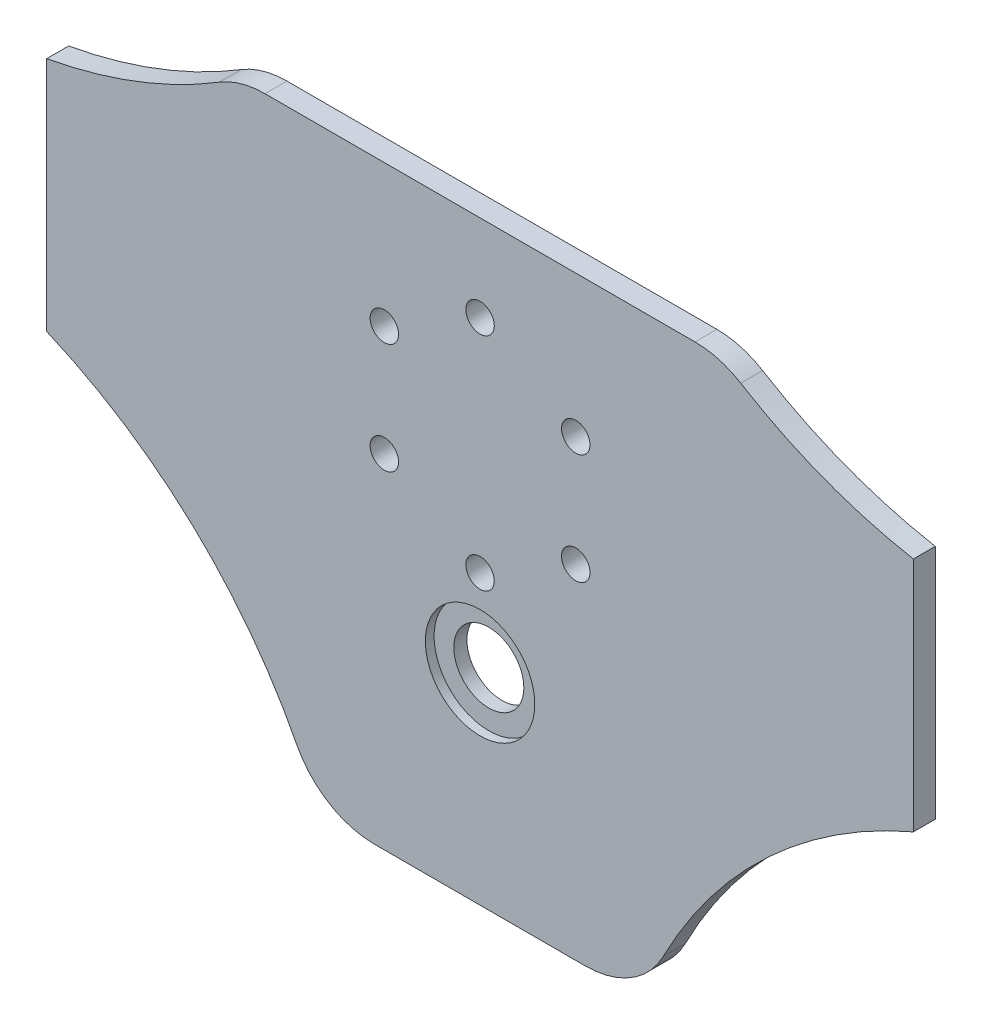
ISO-10303-21;
HEADER;
FILE_DESCRIPTION(('STEP AP214'),'2;1');
FILE_NAME('part.step','',(''),(''),'','','');
FILE_SCHEMA(('AUTOMOTIVE_DESIGN { 1 0 10303 214 1 1 1 1 }'));
ENDSEC;
DATA;
#1=APPLICATION_CONTEXT('core data for automotive mechanical design processes');
#2=APPLICATION_PROTOCOL_DEFINITION('international standard','automotive_design',2000,#1);
#3=PRODUCT_CONTEXT('',#1,'mechanical');
#4=PRODUCT('Part','Part','',(#3));
#5=PRODUCT_RELATED_PRODUCT_CATEGORY('part','',(#4));
#6=PRODUCT_DEFINITION_FORMATION('','',#4);
#7=PRODUCT_DEFINITION_CONTEXT('part definition',#1,'design');
#8=PRODUCT_DEFINITION('design','',#6,#7);
#9=PRODUCT_DEFINITION_SHAPE('','',#8);
#10=(LENGTH_UNIT() NAMED_UNIT(*) SI_UNIT(.MILLI.,.METRE.));
#11=(NAMED_UNIT(*) PLANE_ANGLE_UNIT() SI_UNIT($,.RADIAN.));
#12=(NAMED_UNIT(*) SI_UNIT($,.STERADIAN.) SOLID_ANGLE_UNIT());
#13=UNCERTAINTY_MEASURE_WITH_UNIT(LENGTH_MEASURE(1.E-05),#10,'distance_accuracy_value','');
#14=(GEOMETRIC_REPRESENTATION_CONTEXT(3) GLOBAL_UNCERTAINTY_ASSIGNED_CONTEXT((#13)) GLOBAL_UNIT_ASSIGNED_CONTEXT((#10,
#11,#12)) REPRESENTATION_CONTEXT('',''));
#15=CARTESIAN_POINT('',(0.,0.,0.));
#16=DIRECTION('',(0.,0.,1.));
#17=DIRECTION('',(1.,0.,0.));
#18=AXIS2_PLACEMENT_3D('',#15,#16,#17);
#19=CARTESIAN_POINT('',(0.,-22.,5.));
#20=DIRECTION('',(0.,0.,-1.));
#21=DIRECTION('',(-1.,0.,0.));
#22=AXIS2_PLACEMENT_3D('',#19,#20,#21);
#23=CYLINDRICAL_SURFACE('',#22,8.);
#24=CARTESIAN_POINT('',(0.,-22.,0.));
#25=DIRECTION('',(0.,0.,1.));
#26=DIRECTION('',(1.,0.,0.));
#27=AXIS2_PLACEMENT_3D('',#24,#25,#26);
#28=CIRCLE('',#27,8.);
#29=CARTESIAN_POINT('',(8.00000000000001,-22.,0.));
#30=VERTEX_POINT('',#29);
#31=EDGE_CURVE('E338',#30,#30,#28,.T.);
#32=ORIENTED_EDGE('',*,*,#31,.F.);
#33=EDGE_LOOP('',(#32));
#34=FACE_BOUND('',#33,.T.);
#35=CARTESIAN_POINT('',(0.,-22.,3.));
#36=DIRECTION('',(0.,0.,1.));
#37=DIRECTION('',(1.,0.,0.));
#38=AXIS2_PLACEMENT_3D('',#35,#36,#37);
#39=CIRCLE('',#38,8.);
#40=CARTESIAN_POINT('',(8.00000000000001,-22.,3.));
#41=VERTEX_POINT('',#40);
#42=EDGE_CURVE('E367',#41,#41,#39,.T.);
#43=ORIENTED_EDGE('',*,*,#42,.T.);
#44=EDGE_LOOP('',(#43));
#45=FACE_BOUND('',#44,.T.);
#46=ADVANCED_FACE('F35',(#34,#45),#23,.F.);
#47=CARTESIAN_POINT('',(119.602505223607,163.139457213261,5.));
#48=DIRECTION('',(0.,0.,-1.));
#49=DIRECTION('',(-1.,0.,0.));
#50=AXIS2_PLACEMENT_3D('',#47,#48,#49);
#51=PLANE('',#50);
#52=CARTESIAN_POINT('',(0.,-22.,5.));
#53=DIRECTION('',(0.,0.,1.));
#54=DIRECTION('',(1.,0.,0.));
#55=AXIS2_PLACEMENT_3D('',#52,#53,#54);
#56=CIRCLE('',#55,12.5);
#57=CARTESIAN_POINT('',(12.5,-22.,5.));
#58=VERTEX_POINT('',#57);
#59=EDGE_CURVE('E344',#58,#58,#56,.T.);
#60=ORIENTED_EDGE('',*,*,#59,.F.);
#61=EDGE_LOOP('',(#60));
#62=FACE_BOUND('',#61,.T.);
#63=CARTESIAN_POINT('',(119.602505223607,163.139457213261,5.));
#64=DIRECTION('',(0.,0.,-1.));
#65=DIRECTION('',(-1.,0.,0.));
#66=AXIS2_PLACEMENT_3D('',#63,#64,#65);
#67=CIRCLE('',#66,115.);
#68=CARTESIAN_POINT('',(99.,50.,5.));
#69=VERTEX_POINT('',#68);
#70=CARTESIAN_POINT('',(59.5611162901894,65.0576973649275,5.));
#71=VERTEX_POINT('',#70);
#72=EDGE_CURVE('E180',#69,#71,#67,.T.);
#73=ORIENTED_EDGE('',*,*,#72,.T.);
#74=CARTESIAN_POINT('',(49.1191356061168,48.,5.));
#75=DIRECTION('',(0.,0.,1.));
#76=DIRECTION('',(1.,0.,0.));
#77=AXIS2_PLACEMENT_3D('',#74,#75,#76);
#78=CIRCLE('',#77,20.);
#79=CARTESIAN_POINT('',(49.1191356061168,68.,5.));
#80=VERTEX_POINT('',#79);
#81=EDGE_CURVE('E107',#71,#80,#78,.T.);
#82=ORIENTED_EDGE('',*,*,#81,.T.);
#83=DIRECTION('',(-1.,0.,0.));
#84=VECTOR('',#83,1.);
#85=CARTESIAN_POINT('',(-49.1191356061168,68.,5.));
#86=LINE('',#85,#84);
#87=CARTESIAN_POINT('',(-49.1191356061168,68.,5.));
#88=VERTEX_POINT('',#87);
#89=EDGE_CURVE('E207',#80,#88,#86,.T.);
#90=ORIENTED_EDGE('',*,*,#89,.T.);
#91=CARTESIAN_POINT('',(-49.1191356061168,48.,5.));
#92=DIRECTION('',(0.,0.,1.));
#93=DIRECTION('',(-1.,0.,0.));
#94=AXIS2_PLACEMENT_3D('',#91,#92,#93);
#95=CIRCLE('',#94,20.);
#96=CARTESIAN_POINT('',(-59.5611162901894,65.0576973649275,5.));
#97=VERTEX_POINT('',#96);
#98=EDGE_CURVE('E226',#88,#97,#95,.T.);
#99=ORIENTED_EDGE('',*,*,#98,.T.);
#100=CARTESIAN_POINT('',(-119.602505223607,163.139457213261,5.));
#101=DIRECTION('',(0.,0.,-1.));
#102=DIRECTION('',(1.,0.,0.));
#103=AXIS2_PLACEMENT_3D('',#100,#101,#102);
#104=CIRCLE('',#103,115.);
#105=CARTESIAN_POINT('',(-99.,50.,5.));
#106=VERTEX_POINT('',#105);
#107=EDGE_CURVE('E223',#97,#106,#104,.T.);
#108=ORIENTED_EDGE('',*,*,#107,.T.);
#109=DIRECTION('',(0.,-1.,0.));
#110=VECTOR('',#109,1.);
#111=CARTESIAN_POINT('',(-99.,-3.99999999999998,5.));
#112=LINE('',#111,#110);
#113=CARTESIAN_POINT('',(-99.0000000000001,-4.,5.));
#114=VERTEX_POINT('',#113);
#115=EDGE_CURVE('E225',#106,#114,#112,.T.);
#116=ORIENTED_EDGE('',*,*,#115,.T.);
#117=CARTESIAN_POINT('',(-144.147014112087,-109.767419921084,5.));
#118=DIRECTION('',(0.,0.,-1.));
#119=DIRECTION('',(1.,0.,0.));
#120=AXIS2_PLACEMENT_3D('',#117,#118,#119);
#121=CIRCLE('',#120,115.);
#122=CARTESIAN_POINT('',(-41.8900641106708,-57.1507288771977,5.));
#123=VERTEX_POINT('',#122);
#124=EDGE_CURVE('E228',#114,#123,#121,.T.);
#125=ORIENTED_EDGE('',*,*,#124,.T.);
#126=CARTESIAN_POINT('',(-24.1062467191201,-48.,5.));
#127=DIRECTION('',(0.,0.,1.));
#128=DIRECTION('',(-1.,0.,0.));
#129=AXIS2_PLACEMENT_3D('',#126,#127,#128);
#130=CIRCLE('',#129,20.);
#131=CARTESIAN_POINT('',(-24.1062467191201,-68.,5.));
#132=VERTEX_POINT('',#131);
#133=EDGE_CURVE('E234',#123,#132,#130,.T.);
#134=ORIENTED_EDGE('',*,*,#133,.T.);
#135=DIRECTION('',(1.,0.,0.));
#136=VECTOR('',#135,1.);
#137=CARTESIAN_POINT('',(-24.1062467191201,-68.,5.));
#138=LINE('',#137,#136);
#139=CARTESIAN_POINT('',(24.1062467191201,-68.,5.));
#140=VERTEX_POINT('',#139);
#141=EDGE_CURVE('E139',#132,#140,#138,.T.);
#142=ORIENTED_EDGE('',*,*,#141,.T.);
#143=CARTESIAN_POINT('',(24.1062467191201,-48.,5.));
#144=DIRECTION('',(0.,0.,1.));
#145=DIRECTION('',(1.,0.,0.));
#146=AXIS2_PLACEMENT_3D('',#143,#144,#145);
#147=CIRCLE('',#146,20.);
#148=CARTESIAN_POINT('',(41.8900641106707,-57.1507288771977,5.));
#149=VERTEX_POINT('',#148);
#150=EDGE_CURVE('E132',#140,#149,#147,.T.);
#151=ORIENTED_EDGE('',*,*,#150,.T.);
#152=CARTESIAN_POINT('',(144.147014112087,-109.767419921084,5.));
#153=DIRECTION('',(0.,0.,-1.));
#154=DIRECTION('',(-1.,0.,0.));
#155=AXIS2_PLACEMENT_3D('',#152,#153,#154);
#156=CIRCLE('',#155,115.);
#157=CARTESIAN_POINT('',(99.,-3.99999999999998,5.));
#158=VERTEX_POINT('',#157);
#159=EDGE_CURVE('E137',#149,#158,#156,.T.);
#160=ORIENTED_EDGE('',*,*,#159,.T.);
#161=DIRECTION('',(0.,1.,0.));
#162=VECTOR('',#161,1.);
#163=CARTESIAN_POINT('',(99.,-3.99999999999998,5.));
#164=LINE('',#163,#162);
#165=EDGE_CURVE('E52',#158,#69,#164,.T.);
#166=ORIENTED_EDGE('',*,*,#165,.T.);
#167=EDGE_LOOP('',(#73,#82,#90,#99,#108,#116,#125,#134,#142,#151,#160,#166));
#168=FACE_BOUND('',#167,.T.);
#169=CARTESIAN_POINT('',(21.867141445558,35.6250000000015,5.));
#170=DIRECTION('',(0.,0.,1.));
#171=DIRECTION('',(1.,0.,0.));
#172=AXIS2_PLACEMENT_3D('',#169,#170,#171);
#173=CIRCLE('',#172,3.25);
#174=CARTESIAN_POINT('',(25.117141445558,35.6250000000015,5.));
#175=VERTEX_POINT('',#174);
#176=EDGE_CURVE('E161',#175,#175,#173,.T.);
#177=ORIENTED_EDGE('',*,*,#176,.F.);
#178=EDGE_LOOP('',(#177));
#179=FACE_BOUND('',#178,.T.);
#180=CARTESIAN_POINT('',(21.8671414455597,10.3750000000015,5.));
#181=DIRECTION('',(0.,0.,1.));
#182=DIRECTION('',(1.,0.,0.));
#183=AXIS2_PLACEMENT_3D('',#180,#181,#182);
#184=CIRCLE('',#183,3.25);
#185=CARTESIAN_POINT('',(25.1171414455597,10.3750000000015,5.));
#186=VERTEX_POINT('',#185);
#187=EDGE_CURVE('E311',#186,#186,#184,.T.);
#188=ORIENTED_EDGE('',*,*,#187,.F.);
#189=EDGE_LOOP('',(#188));
#190=FACE_BOUND('',#189,.T.);
#191=CARTESIAN_POINT('',(3.4050629859017E-12,-2.24999999999997,5.));
#192=DIRECTION('',(0.,0.,1.));
#193=DIRECTION('',(1.,0.,0.));
#194=AXIS2_PLACEMENT_3D('',#191,#192,#193);
#195=CIRCLE('',#194,3.25);
#196=CARTESIAN_POINT('',(3.25000000000341,-2.24999999999997,5.));
#197=VERTEX_POINT('',#196);
#198=EDGE_CURVE('E312',#197,#197,#195,.T.);
#199=ORIENTED_EDGE('',*,*,#198,.F.);
#200=EDGE_LOOP('',(#199));
#201=FACE_BOUND('',#200,.T.);
#202=CARTESIAN_POINT('',(-21.8671414455545,10.3749999999987,5.));
#203=DIRECTION('',(0.,0.,1.));
#204=DIRECTION('',(1.,0.,0.));
#205=AXIS2_PLACEMENT_3D('',#202,#203,#204);
#206=CIRCLE('',#205,3.25);
#207=CARTESIAN_POINT('',(-18.6171414455545,10.3749999999987,5.));
#208=VERTEX_POINT('',#207);
#209=EDGE_CURVE('E354',#208,#208,#206,.T.);
#210=ORIENTED_EDGE('',*,*,#209,.F.);
#211=EDGE_LOOP('',(#210));
#212=FACE_BOUND('',#211,.T.);
#213=CARTESIAN_POINT('',(0.,48.25,5.));
#214=DIRECTION('',(0.,0.,1.));
#215=DIRECTION('',(1.,0.,0.));
#216=AXIS2_PLACEMENT_3D('',#213,#214,#215);
#217=CIRCLE('',#216,3.25);
#218=CARTESIAN_POINT('',(3.25,48.25,5.));
#219=VERTEX_POINT('',#218);
#220=EDGE_CURVE('E350',#219,#219,#217,.T.);
#221=ORIENTED_EDGE('',*,*,#220,.F.);
#222=EDGE_LOOP('',(#221));
#223=FACE_BOUND('',#222,.T.);
#224=CARTESIAN_POINT('',(-21.867141445556,35.6249999999987,5.));
#225=DIRECTION('',(0.,0.,1.));
#226=DIRECTION('',(1.,0.,0.));
#227=AXIS2_PLACEMENT_3D('',#224,#225,#226);
#228=CIRCLE('',#227,3.24999999999999);
#229=CARTESIAN_POINT('',(-18.617141445556,35.6249999999987,5.));
#230=VERTEX_POINT('',#229);
#231=EDGE_CURVE('E341',#230,#230,#228,.T.);
#232=ORIENTED_EDGE('',*,*,#231,.F.);
#233=EDGE_LOOP('',(#232));
#234=FACE_BOUND('',#233,.T.);
#235=ADVANCED_FACE('F134',(#62,#168,#179,#190,#201,#212,#223,#234),#51,.F.);
#236=CARTESIAN_POINT('',(119.602505223607,163.139457213261,0.));
#237=DIRECTION('',(0.,0.,-1.));
#238=DIRECTION('',(-1.,0.,0.));
#239=AXIS2_PLACEMENT_3D('',#236,#237,#238);
#240=PLANE('',#239);
#241=CARTESIAN_POINT('',(-21.867141445556,35.6249999999987,0.));
#242=DIRECTION('',(0.,0.,1.));
#243=DIRECTION('',(1.,0.,0.));
#244=AXIS2_PLACEMENT_3D('',#241,#242,#243);
#245=CIRCLE('',#244,3.24999999999999);
#246=CARTESIAN_POINT('',(-18.617141445556,35.6249999999987,0.));
#247=VERTEX_POINT('',#246);
#248=EDGE_CURVE('E302',#247,#247,#245,.T.);
#249=ORIENTED_EDGE('',*,*,#248,.T.);
#250=EDGE_LOOP('',(#249));
#251=FACE_BOUND('',#250,.T.);
#252=CARTESIAN_POINT('',(-21.8671414455545,10.3749999999987,0.));
#253=DIRECTION('',(0.,0.,1.));
#254=DIRECTION('',(1.,0.,0.));
#255=AXIS2_PLACEMENT_3D('',#252,#253,#254);
#256=CIRCLE('',#255,3.25);
#257=CARTESIAN_POINT('',(-18.6171414455545,10.3749999999987,0.));
#258=VERTEX_POINT('',#257);
#259=EDGE_CURVE('E306',#258,#258,#256,.T.);
#260=ORIENTED_EDGE('',*,*,#259,.T.);
#261=EDGE_LOOP('',(#260));
#262=FACE_BOUND('',#261,.T.);
#263=CARTESIAN_POINT('',(21.8671414455597,10.3750000000015,0.));
#264=DIRECTION('',(0.,0.,1.));
#265=DIRECTION('',(1.,0.,0.));
#266=AXIS2_PLACEMENT_3D('',#263,#264,#265);
#267=CIRCLE('',#266,3.25);
#268=CARTESIAN_POINT('',(25.1171414455597,10.3750000000015,0.));
#269=VERTEX_POINT('',#268);
#270=EDGE_CURVE('E309',#269,#269,#267,.T.);
#271=ORIENTED_EDGE('',*,*,#270,.T.);
#272=EDGE_LOOP('',(#271));
#273=FACE_BOUND('',#272,.T.);
#274=CARTESIAN_POINT('',(119.602505223607,163.139457213261,0.));
#275=DIRECTION('',(0.,0.,-1.));
#276=DIRECTION('',(-1.,0.,0.));
#277=AXIS2_PLACEMENT_3D('',#274,#275,#276);
#278=CIRCLE('',#277,115.);
#279=CARTESIAN_POINT('',(99.,50.,0.));
#280=VERTEX_POINT('',#279);
#281=CARTESIAN_POINT('',(59.5611162901894,65.0576973649275,0.));
#282=VERTEX_POINT('',#281);
#283=EDGE_CURVE('E157',#280,#282,#278,.T.);
#284=ORIENTED_EDGE('',*,*,#283,.F.);
#285=DIRECTION('',(0.,1.,0.));
#286=VECTOR('',#285,1.);
#287=CARTESIAN_POINT('',(99.,-3.99999999999998,0.));
#288=LINE('',#287,#286);
#289=CARTESIAN_POINT('',(99.,-3.99999999999998,0.));
#290=VERTEX_POINT('',#289);
#291=EDGE_CURVE('E99',#290,#280,#288,.T.);
#292=ORIENTED_EDGE('',*,*,#291,.F.);
#293=CARTESIAN_POINT('',(144.147014112087,-109.767419921084,0.));
#294=DIRECTION('',(0.,0.,-1.));
#295=DIRECTION('',(-1.,0.,0.));
#296=AXIS2_PLACEMENT_3D('',#293,#294,#295);
#297=CIRCLE('',#296,115.);
#298=CARTESIAN_POINT('',(41.8900641106707,-57.1507288771977,0.));
#299=VERTEX_POINT('',#298);
#300=EDGE_CURVE('E93',#299,#290,#297,.T.);
#301=ORIENTED_EDGE('',*,*,#300,.F.);
#302=CARTESIAN_POINT('',(24.1062467191201,-48.,0.));
#303=DIRECTION('',(0.,0.,1.));
#304=DIRECTION('',(1.,0.,0.));
#305=AXIS2_PLACEMENT_3D('',#302,#303,#304);
#306=CIRCLE('',#305,20.);
#307=CARTESIAN_POINT('',(24.1062467191201,-68.,0.));
#308=VERTEX_POINT('',#307);
#309=EDGE_CURVE('E147',#308,#299,#306,.T.);
#310=ORIENTED_EDGE('',*,*,#309,.F.);
#311=DIRECTION('',(1.,0.,0.));
#312=VECTOR('',#311,1.);
#313=CARTESIAN_POINT('',(-24.1062467191201,-68.,0.));
#314=LINE('',#313,#312);
#315=CARTESIAN_POINT('',(-24.1062467191201,-68.,0.));
#316=VERTEX_POINT('',#315);
#317=EDGE_CURVE('E175',#316,#308,#314,.T.);
#318=ORIENTED_EDGE('',*,*,#317,.F.);
#319=CARTESIAN_POINT('',(-24.1062467191201,-48.,0.));
#320=DIRECTION('',(0.,0.,1.));
#321=DIRECTION('',(-1.,0.,0.));
#322=AXIS2_PLACEMENT_3D('',#319,#320,#321);
#323=CIRCLE('',#322,20.);
#324=CARTESIAN_POINT('',(-41.8900641106708,-57.1507288771977,0.));
#325=VERTEX_POINT('',#324);
#326=EDGE_CURVE('E173',#325,#316,#323,.T.);
#327=ORIENTED_EDGE('',*,*,#326,.F.);
#328=CARTESIAN_POINT('',(-144.147014112087,-109.767419921084,0.));
#329=DIRECTION('',(0.,0.,-1.));
#330=DIRECTION('',(1.,0.,0.));
#331=AXIS2_PLACEMENT_3D('',#328,#329,#330);
#332=CIRCLE('',#331,115.);
#333=CARTESIAN_POINT('',(-99.0000000000001,-4.,0.));
#334=VERTEX_POINT('',#333);
#335=EDGE_CURVE('E171',#334,#325,#332,.T.);
#336=ORIENTED_EDGE('',*,*,#335,.F.);
#337=DIRECTION('',(0.,-1.,0.));
#338=VECTOR('',#337,1.);
#339=CARTESIAN_POINT('',(-99.,-3.99999999999998,0.));
#340=LINE('',#339,#338);
#341=CARTESIAN_POINT('',(-99.,50.,0.));
#342=VERTEX_POINT('',#341);
#343=EDGE_CURVE('E169',#342,#334,#340,.T.);
#344=ORIENTED_EDGE('',*,*,#343,.F.);
#345=CARTESIAN_POINT('',(-119.602505223607,163.139457213261,0.));
#346=DIRECTION('',(0.,0.,-1.));
#347=DIRECTION('',(1.,0.,0.));
#348=AXIS2_PLACEMENT_3D('',#345,#346,#347);
#349=CIRCLE('',#348,115.);
#350=CARTESIAN_POINT('',(-59.5611162901894,65.0576973649275,0.));
#351=VERTEX_POINT('',#350);
#352=EDGE_CURVE('E167',#351,#342,#349,.T.);
#353=ORIENTED_EDGE('',*,*,#352,.F.);
#354=CARTESIAN_POINT('',(-49.1191356061168,48.,0.));
#355=DIRECTION('',(0.,0.,1.));
#356=DIRECTION('',(-1.,0.,0.));
#357=AXIS2_PLACEMENT_3D('',#354,#355,#356);
#358=CIRCLE('',#357,20.);
#359=CARTESIAN_POINT('',(-49.1191356061168,68.,0.));
#360=VERTEX_POINT('',#359);
#361=EDGE_CURVE('E165',#360,#351,#358,.T.);
#362=ORIENTED_EDGE('',*,*,#361,.F.);
#363=DIRECTION('',(-1.,0.,0.));
#364=VECTOR('',#363,1.);
#365=CARTESIAN_POINT('',(-49.1191356061168,68.,0.));
#366=LINE('',#365,#364);
#367=CARTESIAN_POINT('',(49.1191356061168,68.,0.));
#368=VERTEX_POINT('',#367);
#369=EDGE_CURVE('E163',#368,#360,#366,.T.);
#370=ORIENTED_EDGE('',*,*,#369,.F.);
#371=CARTESIAN_POINT('',(49.1191356061168,48.,0.));
#372=DIRECTION('',(0.,0.,1.));
#373=DIRECTION('',(1.,0.,0.));
#374=AXIS2_PLACEMENT_3D('',#371,#372,#373);
#375=CIRCLE('',#374,20.);
#376=EDGE_CURVE('E160',#282,#368,#375,.T.);
#377=ORIENTED_EDGE('',*,*,#376,.F.);
#378=EDGE_LOOP('',(#284,#292,#301,#310,#318,#327,#336,#344,#353,#362,#370,#377));
#379=FACE_BOUND('',#378,.T.);
#380=CARTESIAN_POINT('',(21.867141445558,35.6250000000015,0.));
#381=DIRECTION('',(0.,0.,1.));
#382=DIRECTION('',(1.,0.,0.));
#383=AXIS2_PLACEMENT_3D('',#380,#381,#382);
#384=CIRCLE('',#383,3.25);
#385=CARTESIAN_POINT('',(25.117141445558,35.6250000000015,0.));
#386=VERTEX_POINT('',#385);
#387=EDGE_CURVE('E315',#386,#386,#384,.T.);
#388=ORIENTED_EDGE('',*,*,#387,.T.);
#389=EDGE_LOOP('',(#388));
#390=FACE_BOUND('',#389,.T.);
#391=CARTESIAN_POINT('',(3.4050629859017E-12,-2.24999999999997,0.));
#392=DIRECTION('',(0.,0.,1.));
#393=DIRECTION('',(1.,0.,0.));
#394=AXIS2_PLACEMENT_3D('',#391,#392,#393);
#395=CIRCLE('',#394,3.25);
#396=CARTESIAN_POINT('',(3.25000000000341,-2.24999999999997,0.));
#397=VERTEX_POINT('',#396);
#398=EDGE_CURVE('E318',#397,#397,#395,.T.);
#399=ORIENTED_EDGE('',*,*,#398,.T.);
#400=EDGE_LOOP('',(#399));
#401=FACE_BOUND('',#400,.T.);
#402=CARTESIAN_POINT('',(0.,48.25,0.));
#403=DIRECTION('',(0.,0.,1.));
#404=DIRECTION('',(1.,0.,0.));
#405=AXIS2_PLACEMENT_3D('',#402,#403,#404);
#406=CIRCLE('',#405,3.25);
#407=CARTESIAN_POINT('',(3.25,48.25,0.));
#408=VERTEX_POINT('',#407);
#409=EDGE_CURVE('E336',#408,#408,#406,.T.);
#410=ORIENTED_EDGE('',*,*,#409,.T.);
#411=EDGE_LOOP('',(#410));
#412=FACE_BOUND('',#411,.T.);
#413=ORIENTED_EDGE('',*,*,#31,.T.);
#414=EDGE_LOOP('',(#413));
#415=FACE_BOUND('',#414,.T.);
#416=ADVANCED_FACE('F211',(#251,#262,#273,#379,#390,#401,#412,#415),#240,.T.);
#417=CARTESIAN_POINT('',(119.602505223607,163.139457213261,5.));
#418=DIRECTION('',(0.,0.,-1.));
#419=DIRECTION('',(-1.,0.,0.));
#420=AXIS2_PLACEMENT_3D('',#417,#418,#419);
#421=CYLINDRICAL_SURFACE('',#420,115.);
#422=ORIENTED_EDGE('',*,*,#283,.T.);
#423=DIRECTION('',(0.,0.,-1.));
#424=VECTOR('',#423,1.);
#425=CARTESIAN_POINT('',(59.5611162901894,65.0576973649275,5.));
#426=LINE('',#425,#424);
#427=EDGE_CURVE('E11',#71,#282,#426,.T.);
#428=ORIENTED_EDGE('',*,*,#427,.F.);
#429=ORIENTED_EDGE('',*,*,#72,.F.);
#430=DIRECTION('',(0.,0.,-1.));
#431=VECTOR('',#430,1.);
#432=CARTESIAN_POINT('',(99.,50.,5.));
#433=LINE('',#432,#431);
#434=EDGE_CURVE('E153',#69,#280,#433,.T.);
#435=ORIENTED_EDGE('',*,*,#434,.T.);
#436=EDGE_LOOP('',(#422,#428,#429,#435));
#437=FACE_BOUND('',#436,.T.);
#438=ADVANCED_FACE('F37',(#437),#421,.F.);
#439=CARTESIAN_POINT('',(49.1191356061168,48.,5.));
#440=DIRECTION('',(0.,0.,-1.));
#441=DIRECTION('',(-1.,0.,0.));
#442=AXIS2_PLACEMENT_3D('',#439,#440,#441);
#443=CYLINDRICAL_SURFACE('',#442,20.);
#444=ORIENTED_EDGE('',*,*,#376,.T.);
#445=DIRECTION('',(0.,0.,-1.));
#446=VECTOR('',#445,1.);
#447=CARTESIAN_POINT('',(49.1191356061168,68.,5.));
#448=LINE('',#447,#446);
#449=EDGE_CURVE('E44',#80,#368,#448,.T.);
#450=ORIENTED_EDGE('',*,*,#449,.F.);
#451=ORIENTED_EDGE('',*,*,#81,.F.);
#452=ORIENTED_EDGE('',*,*,#427,.T.);
#453=EDGE_LOOP('',(#444,#450,#451,#452));
#454=FACE_BOUND('',#453,.T.);
#455=ADVANCED_FACE('F298',(#454),#443,.T.);
#456=CARTESIAN_POINT('',(-49.1191356061168,68.,5.));
#457=DIRECTION('',(0.,-1.,0.));
#458=DIRECTION('',(0.,0.,-1.));
#459=AXIS2_PLACEMENT_3D('',#456,#457,#458);
#460=PLANE('',#459);
#461=ORIENTED_EDGE('',*,*,#369,.T.);
#462=DIRECTION('',(0.,0.,-1.));
#463=VECTOR('',#462,1.);
#464=CARTESIAN_POINT('',(-49.1191356061168,68.,5.));
#465=LINE('',#464,#463);
#466=EDGE_CURVE('E199',#88,#360,#465,.T.);
#467=ORIENTED_EDGE('',*,*,#466,.F.);
#468=ORIENTED_EDGE('',*,*,#89,.F.);
#469=ORIENTED_EDGE('',*,*,#449,.T.);
#470=EDGE_LOOP('',(#461,#467,#468,#469));
#471=FACE_BOUND('',#470,.T.);
#472=ADVANCED_FACE('F205',(#471),#460,.F.);
#473=CARTESIAN_POINT('',(-49.1191356061168,48.,5.));
#474=DIRECTION('',(0.,0.,-1.));
#475=DIRECTION('',(-1.,0.,0.));
#476=AXIS2_PLACEMENT_3D('',#473,#474,#475);
#477=CYLINDRICAL_SURFACE('',#476,20.);
#478=ORIENTED_EDGE('',*,*,#361,.T.);
#479=DIRECTION('',(0.,0.,-1.));
#480=VECTOR('',#479,1.);
#481=CARTESIAN_POINT('',(-59.5611162901894,65.0576973649275,5.));
#482=LINE('',#481,#480);
#483=EDGE_CURVE('E196',#97,#351,#482,.T.);
#484=ORIENTED_EDGE('',*,*,#483,.F.);
#485=ORIENTED_EDGE('',*,*,#98,.F.);
#486=ORIENTED_EDGE('',*,*,#466,.T.);
#487=EDGE_LOOP('',(#478,#484,#485,#486));
#488=FACE_BOUND('',#487,.T.);
#489=ADVANCED_FACE('F217',(#488),#477,.T.);
#490=CARTESIAN_POINT('',(-119.602505223607,163.139457213261,5.));
#491=DIRECTION('',(0.,0.,-1.));
#492=DIRECTION('',(-1.,0.,0.));
#493=AXIS2_PLACEMENT_3D('',#490,#491,#492);
#494=CYLINDRICAL_SURFACE('',#493,115.);
#495=ORIENTED_EDGE('',*,*,#352,.T.);
#496=DIRECTION('',(0.,0.,-1.));
#497=VECTOR('',#496,1.);
#498=CARTESIAN_POINT('',(-99.,50.,5.));
#499=LINE('',#498,#497);
#500=EDGE_CURVE('E193',#106,#342,#499,.T.);
#501=ORIENTED_EDGE('',*,*,#500,.F.);
#502=ORIENTED_EDGE('',*,*,#107,.F.);
#503=ORIENTED_EDGE('',*,*,#483,.T.);
#504=EDGE_LOOP('',(#495,#501,#502,#503));
#505=FACE_BOUND('',#504,.T.);
#506=ADVANCED_FACE('F221',(#505),#494,.F.);
#507=CARTESIAN_POINT('',(-99.,-3.99999999999998,5.));
#508=DIRECTION('',(1.,0.,0.));
#509=DIRECTION('',(0.,0.,-1.));
#510=AXIS2_PLACEMENT_3D('',#507,#508,#509);
#511=PLANE('',#510);
#512=ORIENTED_EDGE('',*,*,#343,.T.);
#513=DIRECTION('',(0.,0.,-1.));
#514=VECTOR('',#513,1.);
#515=CARTESIAN_POINT('',(-99.0000000000001,-4.,5.));
#516=LINE('',#515,#514);
#517=EDGE_CURVE('E190',#114,#334,#516,.T.);
#518=ORIENTED_EDGE('',*,*,#517,.F.);
#519=ORIENTED_EDGE('',*,*,#115,.F.);
#520=ORIENTED_EDGE('',*,*,#500,.T.);
#521=EDGE_LOOP('',(#512,#518,#519,#520));
#522=FACE_BOUND('',#521,.T.);
#523=ADVANCED_FACE('F465',(#522),#511,.F.);
#524=CARTESIAN_POINT('',(-144.147014112087,-109.767419921084,5.));
#525=DIRECTION('',(0.,0.,-1.));
#526=DIRECTION('',(-1.,0.,0.));
#527=AXIS2_PLACEMENT_3D('',#524,#525,#526);
#528=CYLINDRICAL_SURFACE('',#527,115.);
#529=ORIENTED_EDGE('',*,*,#335,.T.);
#530=DIRECTION('',(0.,0.,-1.));
#531=VECTOR('',#530,1.);
#532=CARTESIAN_POINT('',(-41.8900641106708,-57.1507288771977,5.));
#533=LINE('',#532,#531);
#534=EDGE_CURVE('E187',#123,#325,#533,.T.);
#535=ORIENTED_EDGE('',*,*,#534,.F.);
#536=ORIENTED_EDGE('',*,*,#124,.F.);
#537=ORIENTED_EDGE('',*,*,#517,.T.);
#538=EDGE_LOOP('',(#529,#535,#536,#537));
#539=FACE_BOUND('',#538,.T.);
#540=ADVANCED_FACE('F457',(#539),#528,.F.);
#541=CARTESIAN_POINT('',(-24.1062467191201,-48.,5.));
#542=DIRECTION('',(0.,0.,-1.));
#543=DIRECTION('',(-1.,0.,0.));
#544=AXIS2_PLACEMENT_3D('',#541,#542,#543);
#545=CYLINDRICAL_SURFACE('',#544,20.);
#546=ORIENTED_EDGE('',*,*,#326,.T.);
#547=DIRECTION('',(0.,0.,-1.));
#548=VECTOR('',#547,1.);
#549=CARTESIAN_POINT('',(-24.1062467191201,-68.,5.));
#550=LINE('',#549,#548);
#551=EDGE_CURVE('E184',#132,#316,#550,.T.);
#552=ORIENTED_EDGE('',*,*,#551,.F.);
#553=ORIENTED_EDGE('',*,*,#133,.F.);
#554=ORIENTED_EDGE('',*,*,#534,.T.);
#555=EDGE_LOOP('',(#546,#552,#553,#554));
#556=FACE_BOUND('',#555,.T.);
#557=ADVANCED_FACE('F240',(#556),#545,.T.);
#558=CARTESIAN_POINT('',(-24.1062467191201,-68.,5.));
#559=DIRECTION('',(0.,1.,0.));
#560=DIRECTION('',(0.,0.,1.));
#561=AXIS2_PLACEMENT_3D('',#558,#559,#560);
#562=PLANE('',#561);
#563=ORIENTED_EDGE('',*,*,#317,.T.);
#564=DIRECTION('',(0.,0.,-1.));
#565=VECTOR('',#564,1.);
#566=CARTESIAN_POINT('',(24.1062467191201,-68.,5.));
#567=LINE('',#566,#565);
#568=EDGE_CURVE('E148',#140,#308,#567,.T.);
#569=ORIENTED_EDGE('',*,*,#568,.F.);
#570=ORIENTED_EDGE('',*,*,#141,.F.);
#571=ORIENTED_EDGE('',*,*,#551,.T.);
#572=EDGE_LOOP('',(#563,#569,#570,#571));
#573=FACE_BOUND('',#572,.T.);
#574=ADVANCED_FACE('F244',(#573),#562,.F.);
#575=CARTESIAN_POINT('',(24.1062467191201,-48.,5.));
#576=DIRECTION('',(0.,0.,-1.));
#577=DIRECTION('',(-1.,0.,0.));
#578=AXIS2_PLACEMENT_3D('',#575,#576,#577);
#579=CYLINDRICAL_SURFACE('',#578,20.);
#580=ORIENTED_EDGE('',*,*,#309,.T.);
#581=DIRECTION('',(0.,0.,-1.));
#582=VECTOR('',#581,1.);
#583=CARTESIAN_POINT('',(41.8900641106707,-57.1507288771977,5.));
#584=LINE('',#583,#582);
#585=EDGE_CURVE('E144',#149,#299,#584,.T.);
#586=ORIENTED_EDGE('',*,*,#585,.F.);
#587=ORIENTED_EDGE('',*,*,#150,.F.);
#588=ORIENTED_EDGE('',*,*,#568,.T.);
#589=EDGE_LOOP('',(#580,#586,#587,#588));
#590=FACE_BOUND('',#589,.T.);
#591=ADVANCED_FACE('F145',(#590),#579,.T.);
#592=CARTESIAN_POINT('',(144.147014112087,-109.767419921084,5.));
#593=DIRECTION('',(0.,0.,-1.));
#594=DIRECTION('',(-1.,0.,0.));
#595=AXIS2_PLACEMENT_3D('',#592,#593,#594);
#596=CYLINDRICAL_SURFACE('',#595,115.);
#597=ORIENTED_EDGE('',*,*,#300,.T.);
#598=DIRECTION('',(0.,0.,-1.));
#599=VECTOR('',#598,1.);
#600=CARTESIAN_POINT('',(99.,-3.99999999999998,5.));
#601=LINE('',#600,#599);
#602=EDGE_CURVE('E149',#158,#290,#601,.T.);
#603=ORIENTED_EDGE('',*,*,#602,.F.);
#604=ORIENTED_EDGE('',*,*,#159,.F.);
#605=ORIENTED_EDGE('',*,*,#585,.T.);
#606=EDGE_LOOP('',(#597,#603,#604,#605));
#607=FACE_BOUND('',#606,.T.);
#608=ADVANCED_FACE('F151',(#607),#596,.F.);
#609=CARTESIAN_POINT('',(99.,-3.99999999999998,5.));
#610=DIRECTION('',(-1.,0.,0.));
#611=DIRECTION('',(0.,0.,1.));
#612=AXIS2_PLACEMENT_3D('',#609,#610,#611);
#613=PLANE('',#612);
#614=ORIENTED_EDGE('',*,*,#291,.T.);
#615=ORIENTED_EDGE('',*,*,#434,.F.);
#616=ORIENTED_EDGE('',*,*,#165,.F.);
#617=ORIENTED_EDGE('',*,*,#602,.T.);
#618=EDGE_LOOP('',(#614,#615,#616,#617));
#619=FACE_BOUND('',#618,.T.);
#620=ADVANCED_FACE('F248',(#619),#613,.F.);
#621=CARTESIAN_POINT('',(21.867141445558,35.6250000000015,5.));
#622=DIRECTION('',(0.,0.,-1.));
#623=DIRECTION('',(-1.,0.,0.));
#624=AXIS2_PLACEMENT_3D('',#621,#622,#623);
#625=CYLINDRICAL_SURFACE('',#624,3.25);
#626=ORIENTED_EDGE('',*,*,#176,.T.);
#627=EDGE_LOOP('',(#626));
#628=FACE_BOUND('',#627,.T.);
#629=ORIENTED_EDGE('',*,*,#387,.F.);
#630=EDGE_LOOP('',(#629));
#631=FACE_BOUND('',#630,.T.);
#632=ADVANCED_FACE('F250',(#628,#631),#625,.F.);
#633=CARTESIAN_POINT('',(21.8671414455597,10.3750000000015,5.));
#634=DIRECTION('',(0.,0.,-1.));
#635=DIRECTION('',(-1.,0.,0.));
#636=AXIS2_PLACEMENT_3D('',#633,#634,#635);
#637=CYLINDRICAL_SURFACE('',#636,3.25);
#638=ORIENTED_EDGE('',*,*,#187,.T.);
#639=EDGE_LOOP('',(#638));
#640=FACE_BOUND('',#639,.T.);
#641=ORIENTED_EDGE('',*,*,#270,.F.);
#642=EDGE_LOOP('',(#641));
#643=FACE_BOUND('',#642,.T.);
#644=ADVANCED_FACE('F256',(#640,#643),#637,.F.);
#645=CARTESIAN_POINT('',(3.4050629859017E-12,-2.24999999999997,5.));
#646=DIRECTION('',(0.,0.,-1.));
#647=DIRECTION('',(-1.,0.,0.));
#648=AXIS2_PLACEMENT_3D('',#645,#646,#647);
#649=CYLINDRICAL_SURFACE('',#648,3.25);
#650=ORIENTED_EDGE('',*,*,#198,.T.);
#651=EDGE_LOOP('',(#650));
#652=FACE_BOUND('',#651,.T.);
#653=ORIENTED_EDGE('',*,*,#398,.F.);
#654=EDGE_LOOP('',(#653));
#655=FACE_BOUND('',#654,.T.);
#656=ADVANCED_FACE('F286',(#652,#655),#649,.F.);
#657=CARTESIAN_POINT('',(-21.8671414455545,10.3749999999987,5.));
#658=DIRECTION('',(0.,0.,-1.));
#659=DIRECTION('',(-1.,0.,0.));
#660=AXIS2_PLACEMENT_3D('',#657,#658,#659);
#661=CYLINDRICAL_SURFACE('',#660,3.25);
#662=ORIENTED_EDGE('',*,*,#209,.T.);
#663=EDGE_LOOP('',(#662));
#664=FACE_BOUND('',#663,.T.);
#665=ORIENTED_EDGE('',*,*,#259,.F.);
#666=EDGE_LOOP('',(#665));
#667=FACE_BOUND('',#666,.T.);
#668=ADVANCED_FACE('F282',(#664,#667),#661,.F.);
#669=CARTESIAN_POINT('',(0.,48.25,5.));
#670=DIRECTION('',(0.,0.,-1.));
#671=DIRECTION('',(-1.,0.,0.));
#672=AXIS2_PLACEMENT_3D('',#669,#670,#671);
#673=CYLINDRICAL_SURFACE('',#672,3.25);
#674=ORIENTED_EDGE('',*,*,#220,.T.);
#675=EDGE_LOOP('',(#674));
#676=FACE_BOUND('',#675,.T.);
#677=ORIENTED_EDGE('',*,*,#409,.F.);
#678=EDGE_LOOP('',(#677));
#679=FACE_BOUND('',#678,.T.);
#680=ADVANCED_FACE('F278',(#676,#679),#673,.F.);
#681=CARTESIAN_POINT('',(-21.867141445556,35.6249999999987,5.));
#682=DIRECTION('',(0.,0.,-1.));
#683=DIRECTION('',(-1.,0.,0.));
#684=AXIS2_PLACEMENT_3D('',#681,#682,#683);
#685=CYLINDRICAL_SURFACE('',#684,3.24999999999999);
#686=ORIENTED_EDGE('',*,*,#231,.T.);
#687=EDGE_LOOP('',(#686));
#688=FACE_BOUND('',#687,.T.);
#689=ORIENTED_EDGE('',*,*,#248,.F.);
#690=EDGE_LOOP('',(#689));
#691=FACE_BOUND('',#690,.T.);
#692=ADVANCED_FACE('F275',(#688,#691),#685,.F.);
#693=CARTESIAN_POINT('',(0.,-22.,3.));
#694=DIRECTION('',(0.,0.,1.));
#695=DIRECTION('',(1.,0.,0.));
#696=AXIS2_PLACEMENT_3D('',#693,#694,#695);
#697=CYLINDRICAL_SURFACE('',#696,12.5);
#698=CARTESIAN_POINT('',(0.,-22.,3.));
#699=DIRECTION('',(0.,0.,1.));
#700=DIRECTION('',(1.,0.,0.));
#701=AXIS2_PLACEMENT_3D('',#698,#699,#700);
#702=CIRCLE('',#701,12.5);
#703=CARTESIAN_POINT('',(12.5,-22.,3.));
#704=VERTEX_POINT('',#703);
#705=EDGE_CURVE('E339',#704,#704,#702,.T.);
#706=ORIENTED_EDGE('',*,*,#705,.F.);
#707=EDGE_LOOP('',(#706));
#708=FACE_BOUND('',#707,.T.);
#709=ORIENTED_EDGE('',*,*,#59,.T.);
#710=EDGE_LOOP('',(#709));
#711=FACE_BOUND('',#710,.T.);
#712=ADVANCED_FACE('F273',(#708,#711),#697,.F.);
#713=CARTESIAN_POINT('',(0.,-22.,3.));
#714=DIRECTION('',(0.,0.,1.));
#715=DIRECTION('',(1.,0.,0.));
#716=AXIS2_PLACEMENT_3D('',#713,#714,#715);
#717=PLANE('',#716);
#718=ORIENTED_EDGE('',*,*,#42,.F.);
#719=EDGE_LOOP('',(#718));
#720=FACE_BOUND('',#719,.T.);
#721=ORIENTED_EDGE('',*,*,#705,.T.);
#722=EDGE_LOOP('',(#721));
#723=FACE_BOUND('',#722,.T.);
#724=ADVANCED_FACE('F372',(#720,#723),#717,.T.);
#725=CLOSED_SHELL('',(#46,#235,#416,#438,#455,#472,#489,#506,#523,#540,#557,#574,#591,#608,#620,
#632,#644,#656,#668,#680,#692,#712,#724));
#726=MANIFOLD_SOLID_BREP('B2',#725);
#727=ADVANCED_BREP_SHAPE_REPRESENTATION('',(#18,#726),#14);
#728=SHAPE_DEFINITION_REPRESENTATION(#9,#727);
ENDSEC;
END-ISO-10303-21;
